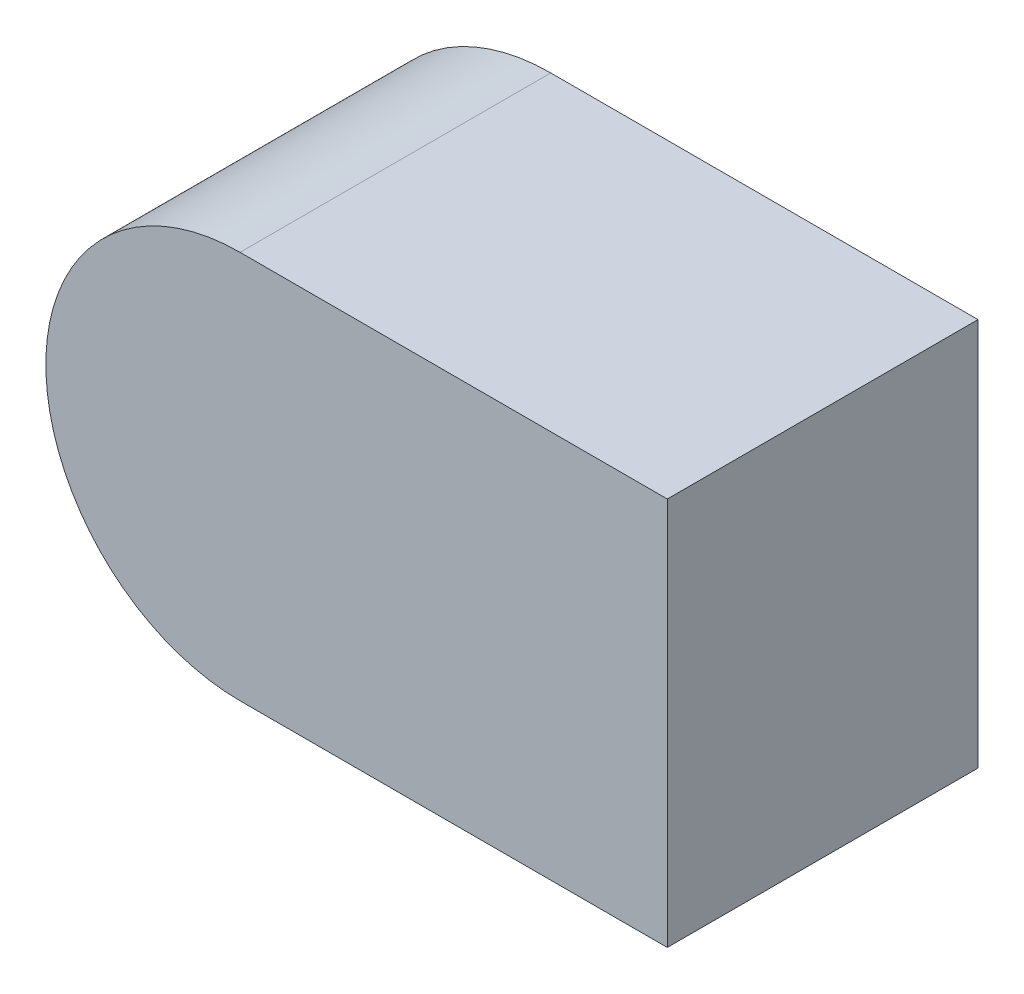
ISO-10303-21;
HEADER;
FILE_DESCRIPTION(('STEP AP214'),'2;1');
FILE_NAME('part.step','',(''),(''),'','','');
FILE_SCHEMA(('AUTOMOTIVE_DESIGN { 1 0 10303 214 1 1 1 1 }'));
ENDSEC;
DATA;
#1=APPLICATION_CONTEXT('core data for automotive mechanical design processes');
#2=APPLICATION_PROTOCOL_DEFINITION('international standard','automotive_design',2000,#1);
#3=PRODUCT_CONTEXT('',#1,'mechanical');
#4=PRODUCT('Part','Part','',(#3));
#5=PRODUCT_RELATED_PRODUCT_CATEGORY('part','',(#4));
#6=PRODUCT_DEFINITION_FORMATION('','',#4);
#7=PRODUCT_DEFINITION_CONTEXT('part definition',#1,'design');
#8=PRODUCT_DEFINITION('design','',#6,#7);
#9=PRODUCT_DEFINITION_SHAPE('','',#8);
#10=(LENGTH_UNIT() NAMED_UNIT(*) SI_UNIT(.MILLI.,.METRE.));
#11=(NAMED_UNIT(*) PLANE_ANGLE_UNIT() SI_UNIT($,.RADIAN.));
#12=(NAMED_UNIT(*) SI_UNIT($,.STERADIAN.) SOLID_ANGLE_UNIT());
#13=UNCERTAINTY_MEASURE_WITH_UNIT(LENGTH_MEASURE(1.E-05),#10,'distance_accuracy_value','');
#14=(GEOMETRIC_REPRESENTATION_CONTEXT(3) GLOBAL_UNCERTAINTY_ASSIGNED_CONTEXT((#13)) GLOBAL_UNIT_ASSIGNED_CONTEXT((#10,
#11,#12)) REPRESENTATION_CONTEXT('',''));
#15=CARTESIAN_POINT('',(0.,0.,0.));
#16=DIRECTION('',(0.,0.,1.));
#17=DIRECTION('',(1.,0.,0.));
#18=AXIS2_PLACEMENT_3D('',#15,#16,#17);
#19=CARTESIAN_POINT('',(1.5,0.125,0.));
#20=DIRECTION('',(0.,1.,0.));
#21=DIRECTION('',(-1.,0.,0.));
#22=AXIS2_PLACEMENT_3D('',#19,#20,#21);
#23=PLANE('',#22);
#24=DIRECTION('',(-1.,0.,0.));
#25=VECTOR('',#24,1.);
#26=CARTESIAN_POINT('',(1.5,0.125,0.));
#27=LINE('',#26,#25);
#28=CARTESIAN_POINT('',(1.5,0.125,0.));
#29=VERTEX_POINT('',#28);
#30=CARTESIAN_POINT('',(1.225,0.125,0.));
#31=VERTEX_POINT('',#30);
#32=EDGE_CURVE('E11',#29,#31,#27,.T.);
#33=ORIENTED_EDGE('',*,*,#32,.T.);
#34=DIRECTION('',(0.,0.,1.));
#35=VECTOR('',#34,1.);
#36=CARTESIAN_POINT('',(1.225,0.125,0.));
#37=LINE('',#36,#35);
#38=CARTESIAN_POINT('',(1.225,0.125,0.2));
#39=VERTEX_POINT('',#38);
#40=EDGE_CURVE('E24',#31,#39,#37,.T.);
#41=ORIENTED_EDGE('',*,*,#40,.T.);
#42=DIRECTION('',(-1.,0.,0.));
#43=VECTOR('',#42,1.);
#44=CARTESIAN_POINT('',(1.5,0.125,0.2));
#45=LINE('',#44,#43);
#46=CARTESIAN_POINT('',(1.5,0.125,0.2));
#47=VERTEX_POINT('',#46);
#48=EDGE_CURVE('E75',#47,#39,#45,.T.);
#49=ORIENTED_EDGE('',*,*,#48,.F.);
#50=DIRECTION('',(0.,0.,1.));
#51=VECTOR('',#50,1.);
#52=CARTESIAN_POINT('',(1.5,0.125,0.));
#53=LINE('',#52,#51);
#54=EDGE_CURVE('E86',#29,#47,#53,.T.);
#55=ORIENTED_EDGE('',*,*,#54,.F.);
#56=EDGE_LOOP('',(#33,#41,#49,#55));
#57=FACE_BOUND('',#56,.T.);
#58=ADVANCED_FACE('F17',(#57),#23,.T.);
#59=CARTESIAN_POINT('',(1.5,-0.125,0.));
#60=DIRECTION('',(1.,0.,0.));
#61=DIRECTION('',(0.,1.,0.));
#62=AXIS2_PLACEMENT_3D('',#59,#60,#61);
#63=PLANE('',#62);
#64=DIRECTION('',(0.,1.,0.));
#65=VECTOR('',#64,1.);
#66=CARTESIAN_POINT('',(1.5,-0.125,0.));
#67=LINE('',#66,#65);
#68=CARTESIAN_POINT('',(1.5,-0.125,0.));
#69=VERTEX_POINT('',#68);
#70=EDGE_CURVE('E83',#69,#29,#67,.T.);
#71=ORIENTED_EDGE('',*,*,#70,.T.);
#72=ORIENTED_EDGE('',*,*,#54,.T.);
#73=DIRECTION('',(0.,1.,0.));
#74=VECTOR('',#73,1.);
#75=CARTESIAN_POINT('',(1.5,-0.125,0.2));
#76=LINE('',#75,#74);
#77=CARTESIAN_POINT('',(1.5,-0.125,0.2));
#78=VERTEX_POINT('',#77);
#79=EDGE_CURVE('E81',#78,#47,#76,.T.);
#80=ORIENTED_EDGE('',*,*,#79,.F.);
#81=DIRECTION('',(0.,0.,1.));
#82=VECTOR('',#81,1.);
#83=CARTESIAN_POINT('',(1.5,-0.125,0.));
#84=LINE('',#83,#82);
#85=EDGE_CURVE('E61',#69,#78,#84,.T.);
#86=ORIENTED_EDGE('',*,*,#85,.F.);
#87=EDGE_LOOP('',(#71,#72,#80,#86));
#88=FACE_BOUND('',#87,.T.);
#89=ADVANCED_FACE('F91',(#88),#63,.T.);
#90=CARTESIAN_POINT('',(1.225,-0.125,0.));
#91=DIRECTION('',(0.,-1.,0.));
#92=DIRECTION('',(1.,0.,0.));
#93=AXIS2_PLACEMENT_3D('',#90,#91,#92);
#94=PLANE('',#93);
#95=DIRECTION('',(1.,0.,0.));
#96=VECTOR('',#95,1.);
#97=CARTESIAN_POINT('',(1.225,-0.125,0.));
#98=LINE('',#97,#96);
#99=CARTESIAN_POINT('',(1.225,-0.125,0.));
#100=VERTEX_POINT('',#99);
#101=EDGE_CURVE('E65',#100,#69,#98,.T.);
#102=ORIENTED_EDGE('',*,*,#101,.T.);
#103=ORIENTED_EDGE('',*,*,#85,.T.);
#104=DIRECTION('',(1.,0.,0.));
#105=VECTOR('',#104,1.);
#106=CARTESIAN_POINT('',(1.225,-0.125,0.2));
#107=LINE('',#106,#105);
#108=CARTESIAN_POINT('',(1.225,-0.125,0.2));
#109=VERTEX_POINT('',#108);
#110=EDGE_CURVE('E54',#109,#78,#107,.T.);
#111=ORIENTED_EDGE('',*,*,#110,.F.);
#112=DIRECTION('',(0.,0.,1.));
#113=VECTOR('',#112,1.);
#114=CARTESIAN_POINT('',(1.225,-0.125,0.));
#115=LINE('',#114,#113);
#116=EDGE_CURVE('E58',#100,#109,#115,.T.);
#117=ORIENTED_EDGE('',*,*,#116,.F.);
#118=EDGE_LOOP('',(#102,#103,#111,#117));
#119=FACE_BOUND('',#118,.T.);
#120=ADVANCED_FACE('F57',(#119),#94,.T.);
#121=CARTESIAN_POINT('',(1.225,0.,0.));
#122=DIRECTION('',(0.,0.,1.));
#123=DIRECTION('',(0.,1.,0.));
#124=AXIS2_PLACEMENT_3D('',#121,#122,#123);
#125=CYLINDRICAL_SURFACE('',#124,0.125);
#126=CARTESIAN_POINT('',(1.225,0.,0.));
#127=DIRECTION('',(0.,0.,1.));
#128=DIRECTION('',(0.,1.,0.));
#129=AXIS2_PLACEMENT_3D('',#126,#127,#128);
#130=CIRCLE('',#129,0.125);
#131=EDGE_CURVE('E71',#31,#100,#130,.T.);
#132=ORIENTED_EDGE('',*,*,#131,.T.);
#133=ORIENTED_EDGE('',*,*,#116,.T.);
#134=CARTESIAN_POINT('',(1.225,0.,0.2));
#135=DIRECTION('',(0.,0.,1.));
#136=DIRECTION('',(0.,1.,0.));
#137=AXIS2_PLACEMENT_3D('',#134,#135,#136);
#138=CIRCLE('',#137,0.125);
#139=EDGE_CURVE('E70',#39,#109,#138,.T.);
#140=ORIENTED_EDGE('',*,*,#139,.F.);
#141=ORIENTED_EDGE('',*,*,#40,.F.);
#142=EDGE_LOOP('',(#132,#133,#140,#141));
#143=FACE_BOUND('',#142,.T.);
#144=ADVANCED_FACE('F69',(#143),#125,.T.);
#145=CARTESIAN_POINT('',(1.3,0.,0.2));
#146=DIRECTION('',(0.,0.,1.));
#147=DIRECTION('',(1.,0.,0.));
#148=AXIS2_PLACEMENT_3D('',#145,#146,#147);
#149=PLANE('',#148);
#150=ORIENTED_EDGE('',*,*,#139,.T.);
#151=ORIENTED_EDGE('',*,*,#110,.T.);
#152=ORIENTED_EDGE('',*,*,#79,.T.);
#153=ORIENTED_EDGE('',*,*,#48,.T.);
#154=EDGE_LOOP('',(#150,#151,#152,#153));
#155=FACE_BOUND('',#154,.T.);
#156=ADVANCED_FACE('F74',(#155),#149,.T.);
#157=CARTESIAN_POINT('',(1.3,0.,0.));
#158=DIRECTION('',(0.,0.,1.));
#159=DIRECTION('',(1.,0.,0.));
#160=AXIS2_PLACEMENT_3D('',#157,#158,#159);
#161=PLANE('',#160);
#162=ORIENTED_EDGE('',*,*,#131,.F.);
#163=ORIENTED_EDGE('',*,*,#32,.F.);
#164=ORIENTED_EDGE('',*,*,#70,.F.);
#165=ORIENTED_EDGE('',*,*,#101,.F.);
#166=EDGE_LOOP('',(#162,#163,#164,#165));
#167=FACE_BOUND('',#166,.T.);
#168=ADVANCED_FACE('F89',(#167),#161,.F.);
#169=CLOSED_SHELL('',(#58,#89,#120,#144,#156,#168));
#170=MANIFOLD_SOLID_BREP('B1',#169);
#171=ADVANCED_BREP_SHAPE_REPRESENTATION('',(#18,#170),#14);
#172=SHAPE_DEFINITION_REPRESENTATION(#9,#171);
ENDSEC;
END-ISO-10303-21;
